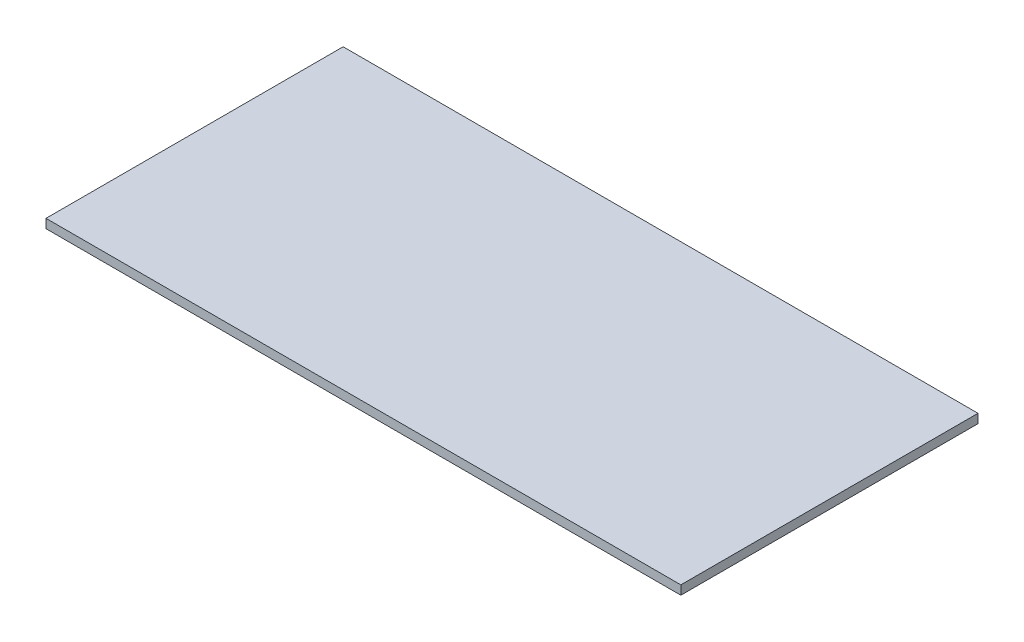
ISO-10303-21;
HEADER;
FILE_DESCRIPTION(('STEP AP214'),'2;1');
FILE_NAME('part.step','',(''),(''),'','','');
FILE_SCHEMA(('AUTOMOTIVE_DESIGN { 1 0 10303 214 1 1 1 1 }'));
ENDSEC;
DATA;
#1=APPLICATION_CONTEXT('core data for automotive mechanical design processes');
#2=APPLICATION_PROTOCOL_DEFINITION('international standard','automotive_design',2000,#1);
#3=PRODUCT_CONTEXT('',#1,'mechanical');
#4=PRODUCT('Part','Part','',(#3));
#5=PRODUCT_RELATED_PRODUCT_CATEGORY('part','',(#4));
#6=PRODUCT_DEFINITION_FORMATION('','',#4);
#7=PRODUCT_DEFINITION_CONTEXT('part definition',#1,'design');
#8=PRODUCT_DEFINITION('design','',#6,#7);
#9=PRODUCT_DEFINITION_SHAPE('','',#8);
#10=(LENGTH_UNIT() NAMED_UNIT(*) SI_UNIT(.MILLI.,.METRE.));
#11=(NAMED_UNIT(*) PLANE_ANGLE_UNIT() SI_UNIT($,.RADIAN.));
#12=(NAMED_UNIT(*) SI_UNIT($,.STERADIAN.) SOLID_ANGLE_UNIT());
#13=UNCERTAINTY_MEASURE_WITH_UNIT(LENGTH_MEASURE(1.E-05),#10,'distance_accuracy_value','');
#14=(GEOMETRIC_REPRESENTATION_CONTEXT(3) GLOBAL_UNCERTAINTY_ASSIGNED_CONTEXT((#13)) GLOBAL_UNIT_ASSIGNED_CONTEXT((#10,
#11,#12)) REPRESENTATION_CONTEXT('',''));
#15=CARTESIAN_POINT('',(0.,0.,0.));
#16=DIRECTION('',(0.,0.,1.));
#17=DIRECTION('',(1.,0.,0.));
#18=AXIS2_PLACEMENT_3D('',#15,#16,#17);
#19=CARTESIAN_POINT('',(634.5,18.,297.));
#20=DIRECTION('',(-1.,0.,0.));
#21=DIRECTION('',(0.,0.,1.));
#22=AXIS2_PLACEMENT_3D('',#19,#20,#21);
#23=PLANE('',#22);
#24=DIRECTION('',(0.,0.,-1.));
#25=VECTOR('',#24,1.);
#26=CARTESIAN_POINT('',(634.5,0.,297.));
#27=LINE('',#26,#25);
#28=CARTESIAN_POINT('',(634.5,0.,297.));
#29=VERTEX_POINT('',#28);
#30=CARTESIAN_POINT('',(634.5,0.,-297.));
#31=VERTEX_POINT('',#30);
#32=EDGE_CURVE('E96',#29,#31,#27,.T.);
#33=ORIENTED_EDGE('',*,*,#32,.T.);
#34=DIRECTION('',(0.,-1.,0.));
#35=VECTOR('',#34,1.);
#36=CARTESIAN_POINT('',(634.5,18.,-297.));
#37=LINE('',#36,#35);
#38=CARTESIAN_POINT('',(634.5,18.,-297.));
#39=VERTEX_POINT('',#38);
#40=EDGE_CURVE('E11',#39,#31,#37,.T.);
#41=ORIENTED_EDGE('',*,*,#40,.F.);
#42=DIRECTION('',(0.,0.,-1.));
#43=VECTOR('',#42,1.);
#44=CARTESIAN_POINT('',(634.5,18.,297.));
#45=LINE('',#44,#43);
#46=CARTESIAN_POINT('',(634.5,18.,297.));
#47=VERTEX_POINT('',#46);
#48=EDGE_CURVE('E84',#47,#39,#45,.T.);
#49=ORIENTED_EDGE('',*,*,#48,.F.);
#50=DIRECTION('',(0.,-1.,0.));
#51=VECTOR('',#50,1.);
#52=CARTESIAN_POINT('',(634.5,18.,297.));
#53=LINE('',#52,#51);
#54=EDGE_CURVE('E92',#47,#29,#53,.T.);
#55=ORIENTED_EDGE('',*,*,#54,.T.);
#56=EDGE_LOOP('',(#33,#41,#49,#55));
#57=FACE_BOUND('',#56,.T.);
#58=ADVANCED_FACE('F33',(#57),#23,.F.);
#59=CARTESIAN_POINT('',(-634.5,18.,-297.));
#60=DIRECTION('',(0.,0.,1.));
#61=DIRECTION('',(1.,0.,0.));
#62=AXIS2_PLACEMENT_3D('',#59,#60,#61);
#63=PLANE('',#62);
#64=DIRECTION('',(-1.,0.,0.));
#65=VECTOR('',#64,1.);
#66=CARTESIAN_POINT('',(-634.5,0.,-297.));
#67=LINE('',#66,#65);
#68=CARTESIAN_POINT('',(-634.5,0.,-297.));
#69=VERTEX_POINT('',#68);
#70=EDGE_CURVE('E88',#31,#69,#67,.T.);
#71=ORIENTED_EDGE('',*,*,#70,.T.);
#72=DIRECTION('',(0.,-1.,0.));
#73=VECTOR('',#72,1.);
#74=CARTESIAN_POINT('',(-634.5,18.,-297.));
#75=LINE('',#74,#73);
#76=CARTESIAN_POINT('',(-634.5,18.,-297.));
#77=VERTEX_POINT('',#76);
#78=EDGE_CURVE('E41',#77,#69,#75,.T.);
#79=ORIENTED_EDGE('',*,*,#78,.F.);
#80=DIRECTION('',(-1.,0.,0.));
#81=VECTOR('',#80,1.);
#82=CARTESIAN_POINT('',(-634.5,18.,-297.));
#83=LINE('',#82,#81);
#84=EDGE_CURVE('E79',#39,#77,#83,.T.);
#85=ORIENTED_EDGE('',*,*,#84,.F.);
#86=ORIENTED_EDGE('',*,*,#40,.T.);
#87=EDGE_LOOP('',(#71,#79,#85,#86));
#88=FACE_BOUND('',#87,.T.);
#89=ADVANCED_FACE('F87',(#88),#63,.F.);
#90=CARTESIAN_POINT('',(-634.5,18.,297.));
#91=DIRECTION('',(1.,0.,0.));
#92=DIRECTION('',(0.,0.,-1.));
#93=AXIS2_PLACEMENT_3D('',#90,#91,#92);
#94=PLANE('',#93);
#95=DIRECTION('',(0.,0.,1.));
#96=VECTOR('',#95,1.);
#97=CARTESIAN_POINT('',(-634.5,0.,297.));
#98=LINE('',#97,#96);
#99=CARTESIAN_POINT('',(-634.5,0.,297.));
#100=VERTEX_POINT('',#99);
#101=EDGE_CURVE('E66',#69,#100,#98,.T.);
#102=ORIENTED_EDGE('',*,*,#101,.T.);
#103=DIRECTION('',(0.,-1.,0.));
#104=VECTOR('',#103,1.);
#105=CARTESIAN_POINT('',(-634.5,18.,297.));
#106=LINE('',#105,#104);
#107=CARTESIAN_POINT('',(-634.5,18.,297.));
#108=VERTEX_POINT('',#107);
#109=EDGE_CURVE('E89',#108,#100,#106,.T.);
#110=ORIENTED_EDGE('',*,*,#109,.F.);
#111=DIRECTION('',(0.,0.,1.));
#112=VECTOR('',#111,1.);
#113=CARTESIAN_POINT('',(-634.5,18.,297.));
#114=LINE('',#113,#112);
#115=EDGE_CURVE('E82',#77,#108,#114,.T.);
#116=ORIENTED_EDGE('',*,*,#115,.F.);
#117=ORIENTED_EDGE('',*,*,#78,.T.);
#118=EDGE_LOOP('',(#102,#110,#116,#117));
#119=FACE_BOUND('',#118,.T.);
#120=ADVANCED_FACE('F90',(#119),#94,.F.);
#121=CARTESIAN_POINT('',(-634.5,18.,297.));
#122=DIRECTION('',(0.,0.,-1.));
#123=DIRECTION('',(-1.,0.,0.));
#124=AXIS2_PLACEMENT_3D('',#121,#122,#123);
#125=PLANE('',#124);
#126=DIRECTION('',(1.,0.,0.));
#127=VECTOR('',#126,1.);
#128=CARTESIAN_POINT('',(-634.5,0.,297.));
#129=LINE('',#128,#127);
#130=EDGE_CURVE('E72',#100,#29,#129,.T.);
#131=ORIENTED_EDGE('',*,*,#130,.T.);
#132=ORIENTED_EDGE('',*,*,#54,.F.);
#133=DIRECTION('',(1.,0.,0.));
#134=VECTOR('',#133,1.);
#135=CARTESIAN_POINT('',(-634.5,18.,297.));
#136=LINE('',#135,#134);
#137=EDGE_CURVE('E49',#108,#47,#136,.T.);
#138=ORIENTED_EDGE('',*,*,#137,.F.);
#139=ORIENTED_EDGE('',*,*,#109,.T.);
#140=EDGE_LOOP('',(#131,#132,#138,#139));
#141=FACE_BOUND('',#140,.T.);
#142=ADVANCED_FACE('F103',(#141),#125,.F.);
#143=CARTESIAN_POINT('',(0.,18.,0.));
#144=DIRECTION('',(0.,-1.,0.));
#145=DIRECTION('',(0.,0.,-1.));
#146=AXIS2_PLACEMENT_3D('',#143,#144,#145);
#147=PLANE('',#146);
#148=ORIENTED_EDGE('',*,*,#48,.T.);
#149=ORIENTED_EDGE('',*,*,#84,.T.);
#150=ORIENTED_EDGE('',*,*,#115,.T.);
#151=ORIENTED_EDGE('',*,*,#137,.T.);
#152=EDGE_LOOP('',(#148,#149,#150,#151));
#153=FACE_BOUND('',#152,.T.);
#154=ADVANCED_FACE('F80',(#153),#147,.F.);
#155=CARTESIAN_POINT('',(0.,0.,0.));
#156=DIRECTION('',(0.,-1.,0.));
#157=DIRECTION('',(0.,0.,-1.));
#158=AXIS2_PLACEMENT_3D('',#155,#156,#157);
#159=PLANE('',#158);
#160=ORIENTED_EDGE('',*,*,#32,.F.);
#161=ORIENTED_EDGE('',*,*,#130,.F.);
#162=ORIENTED_EDGE('',*,*,#101,.F.);
#163=ORIENTED_EDGE('',*,*,#70,.F.);
#164=EDGE_LOOP('',(#160,#161,#162,#163));
#165=FACE_BOUND('',#164,.T.);
#166=ADVANCED_FACE('F106',(#165),#159,.T.);
#167=CLOSED_SHELL('',(#58,#89,#120,#142,#154,#166));
#168=MANIFOLD_SOLID_BREP('B2',#167);
#169=ADVANCED_BREP_SHAPE_REPRESENTATION('',(#18,#168),#14);
#170=SHAPE_DEFINITION_REPRESENTATION(#9,#169);
ENDSEC;
END-ISO-10303-21;
